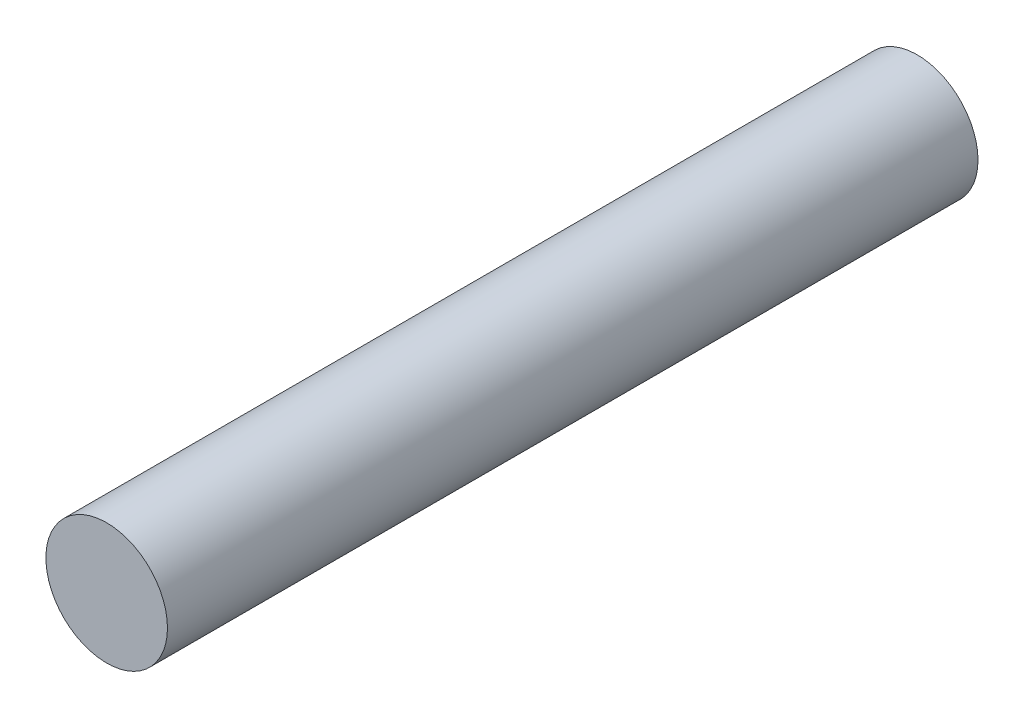
ISO-10303-21;
HEADER;
FILE_DESCRIPTION(('STEP AP214'),'2;1');
FILE_NAME('part.step','',(''),(''),'','','');
FILE_SCHEMA(('AUTOMOTIVE_DESIGN { 1 0 10303 214 1 1 1 1 }'));
ENDSEC;
DATA;
#1=APPLICATION_CONTEXT('core data for automotive mechanical design processes');
#2=APPLICATION_PROTOCOL_DEFINITION('international standard','automotive_design',2000,#1);
#3=PRODUCT_CONTEXT('',#1,'mechanical');
#4=PRODUCT('Part','Part','',(#3));
#5=PRODUCT_RELATED_PRODUCT_CATEGORY('part','',(#4));
#6=PRODUCT_DEFINITION_FORMATION('','',#4);
#7=PRODUCT_DEFINITION_CONTEXT('part definition',#1,'design');
#8=PRODUCT_DEFINITION('design','',#6,#7);
#9=PRODUCT_DEFINITION_SHAPE('','',#8);
#10=(LENGTH_UNIT() NAMED_UNIT(*) SI_UNIT(.MILLI.,.METRE.));
#11=(NAMED_UNIT(*) PLANE_ANGLE_UNIT() SI_UNIT($,.RADIAN.));
#12=(NAMED_UNIT(*) SI_UNIT($,.STERADIAN.) SOLID_ANGLE_UNIT());
#13=UNCERTAINTY_MEASURE_WITH_UNIT(LENGTH_MEASURE(1.E-05),#10,'distance_accuracy_value','');
#14=(GEOMETRIC_REPRESENTATION_CONTEXT(3) GLOBAL_UNCERTAINTY_ASSIGNED_CONTEXT((#13)) GLOBAL_UNIT_ASSIGNED_CONTEXT((#10,
#11,#12)) REPRESENTATION_CONTEXT('',''));
#15=CARTESIAN_POINT('',(0.,0.,0.));
#16=DIRECTION('',(0.,0.,1.));
#17=DIRECTION('',(1.,0.,0.));
#18=AXIS2_PLACEMENT_3D('',#15,#16,#17);
#19=CARTESIAN_POINT('',(0.,0.,20.));
#20=DIRECTION('',(0.,0.,-1.));
#21=DIRECTION('',(-1.,0.,0.));
#22=AXIS2_PLACEMENT_3D('',#19,#20,#21);
#23=CYLINDRICAL_SURFACE('',#22,1.5);
#24=CARTESIAN_POINT('',(0.,0.,20.));
#25=DIRECTION('',(0.,0.,1.));
#26=DIRECTION('',(1.,0.,0.));
#27=AXIS2_PLACEMENT_3D('',#24,#25,#26);
#28=CIRCLE('',#27,1.5);
#29=CARTESIAN_POINT('',(1.5,0.,20.));
#30=VERTEX_POINT('',#29);
#31=EDGE_CURVE('E10',#30,#30,#28,.T.);
#32=ORIENTED_EDGE('',*,*,#31,.F.);
#33=EDGE_LOOP('',(#32));
#34=FACE_BOUND('',#33,.T.);
#35=CARTESIAN_POINT('',(0.,0.,0.));
#36=DIRECTION('',(0.,0.,1.));
#37=DIRECTION('',(1.,0.,0.));
#38=AXIS2_PLACEMENT_3D('',#35,#36,#37);
#39=CIRCLE('',#38,1.5);
#40=CARTESIAN_POINT('',(1.5,0.,0.));
#41=VERTEX_POINT('',#40);
#42=EDGE_CURVE('E46',#41,#41,#39,.T.);
#43=ORIENTED_EDGE('',*,*,#42,.T.);
#44=EDGE_LOOP('',(#43));
#45=FACE_BOUND('',#44,.T.);
#46=ADVANCED_FACE('F43',(#34,#45),#23,.T.);
#47=CARTESIAN_POINT('',(0.,0.,20.));
#48=DIRECTION('',(0.,0.,1.));
#49=DIRECTION('',(1.,0.,0.));
#50=AXIS2_PLACEMENT_3D('',#47,#48,#49);
#51=PLANE('',#50);
#52=ORIENTED_EDGE('',*,*,#31,.T.);
#53=EDGE_LOOP('',(#52));
#54=FACE_BOUND('',#53,.T.);
#55=ADVANCED_FACE('F60',(#54),#51,.T.);
#56=CARTESIAN_POINT('',(0.,0.,0.));
#57=DIRECTION('',(0.,0.,1.));
#58=DIRECTION('',(1.,0.,0.));
#59=AXIS2_PLACEMENT_3D('',#56,#57,#58);
#60=PLANE('',#59);
#61=ORIENTED_EDGE('',*,*,#42,.F.);
#62=EDGE_LOOP('',(#61));
#63=FACE_BOUND('',#62,.T.);
#64=ADVANCED_FACE('F58',(#63),#60,.F.);
#65=CLOSED_SHELL('',(#46,#55,#64));
#66=MANIFOLD_SOLID_BREP('B2',#65);
#67=ADVANCED_BREP_SHAPE_REPRESENTATION('',(#18,#66),#14);
#68=SHAPE_DEFINITION_REPRESENTATION(#9,#67);
ENDSEC;
END-ISO-10303-21;
